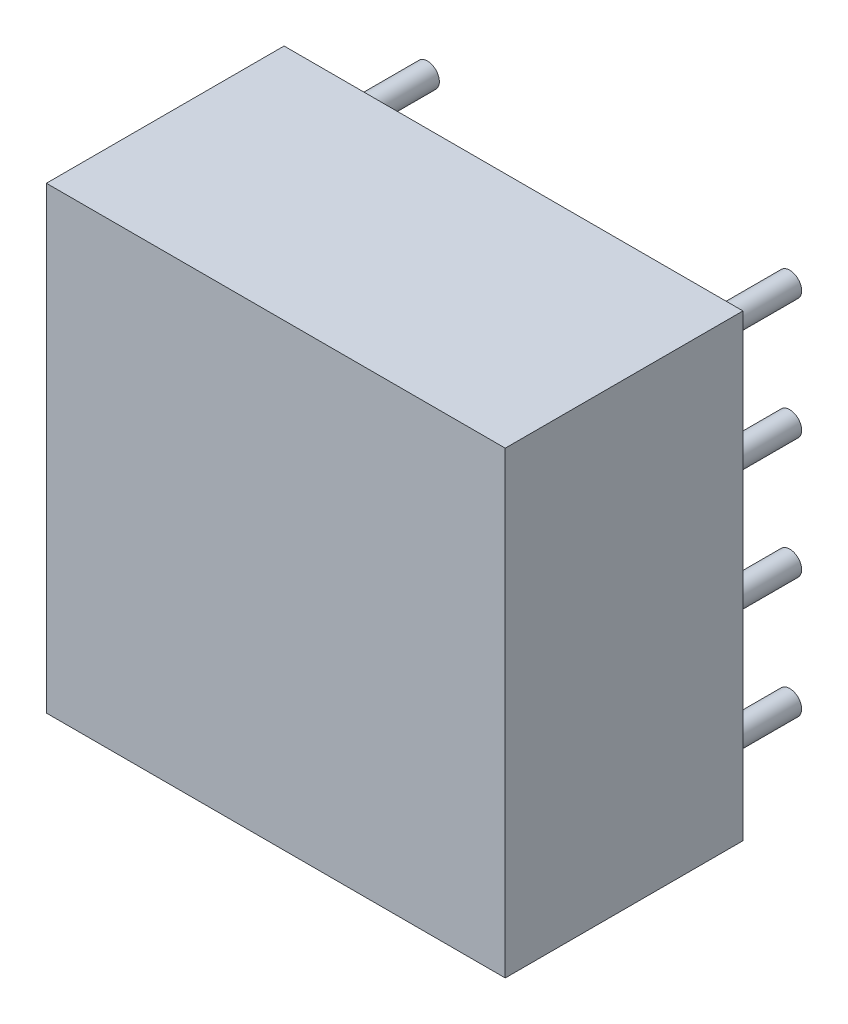
ISO-10303-21;
HEADER;
FILE_DESCRIPTION(('STEP AP214'),'2;1');
FILE_NAME('part.step','',(''),(''),'','','');
FILE_SCHEMA(('AUTOMOTIVE_DESIGN { 1 0 10303 214 1 1 1 1 }'));
ENDSEC;
DATA;
#1=APPLICATION_CONTEXT('core data for automotive mechanical design processes');
#2=APPLICATION_PROTOCOL_DEFINITION('international standard','automotive_design',2000,#1);
#3=PRODUCT_CONTEXT('',#1,'mechanical');
#4=PRODUCT('Part','Part','',(#3));
#5=PRODUCT_RELATED_PRODUCT_CATEGORY('part','',(#4));
#6=PRODUCT_DEFINITION_FORMATION('','',#4);
#7=PRODUCT_DEFINITION_CONTEXT('part definition',#1,'design');
#8=PRODUCT_DEFINITION('design','',#6,#7);
#9=PRODUCT_DEFINITION_SHAPE('','',#8);
#10=(LENGTH_UNIT() NAMED_UNIT(*) SI_UNIT(.MILLI.,.METRE.));
#11=(NAMED_UNIT(*) PLANE_ANGLE_UNIT() SI_UNIT($,.RADIAN.));
#12=(NAMED_UNIT(*) SI_UNIT($,.STERADIAN.) SOLID_ANGLE_UNIT());
#13=UNCERTAINTY_MEASURE_WITH_UNIT(LENGTH_MEASURE(1.E-05),#10,'distance_accuracy_value','');
#14=(GEOMETRIC_REPRESENTATION_CONTEXT(3) GLOBAL_UNCERTAINTY_ASSIGNED_CONTEXT((#13)) GLOBAL_UNIT_ASSIGNED_CONTEXT((#10,
#11,#12)) REPRESENTATION_CONTEXT('',''));
#15=CARTESIAN_POINT('',(0.,0.,0.));
#16=DIRECTION('',(0.,0.,1.));
#17=DIRECTION('',(1.,0.,0.));
#18=AXIS2_PLACEMENT_3D('',#15,#16,#17);
#19=CARTESIAN_POINT('',(7.62,7.62,-2.));
#20=DIRECTION('',(0.,0.,1.));
#21=DIRECTION('',(1.,0.,0.));
#22=AXIS2_PLACEMENT_3D('',#19,#20,#21);
#23=CYLINDRICAL_SURFACE('',#22,0.25);
#24=CARTESIAN_POINT('',(7.62,7.62,-2.));
#25=DIRECTION('',(0.,0.,1.));
#26=DIRECTION('',(1.,0.,0.));
#27=AXIS2_PLACEMENT_3D('',#24,#25,#26);
#28=CIRCLE('',#27,0.25);
#29=CARTESIAN_POINT('',(7.87,7.62,-2.));
#30=VERTEX_POINT('',#29);
#31=EDGE_CURVE('E11',#30,#30,#28,.T.);
#32=ORIENTED_EDGE('',*,*,#31,.T.);
#33=EDGE_LOOP('',(#32));
#34=FACE_BOUND('',#33,.T.);
#35=CARTESIAN_POINT('',(7.62,7.62,0.));
#36=DIRECTION('',(0.,0.,1.));
#37=DIRECTION('',(1.,0.,0.));
#38=AXIS2_PLACEMENT_3D('',#35,#36,#37);
#39=CIRCLE('',#38,0.25);
#40=CARTESIAN_POINT('',(7.87,7.62,0.));
#41=VERTEX_POINT('',#40);
#42=EDGE_CURVE('E43',#41,#41,#39,.T.);
#43=ORIENTED_EDGE('',*,*,#42,.F.);
#44=EDGE_LOOP('',(#43));
#45=FACE_BOUND('',#44,.T.);
#46=ADVANCED_FACE('F40',(#34,#45),#23,.T.);
#47=CARTESIAN_POINT('',(7.62,7.62,-2.));
#48=DIRECTION('',(0.,0.,1.));
#49=DIRECTION('',(1.,0.,0.));
#50=AXIS2_PLACEMENT_3D('',#47,#48,#49);
#51=PLANE('',#50);
#52=ORIENTED_EDGE('',*,*,#31,.F.);
#53=EDGE_LOOP('',(#52));
#54=FACE_BOUND('',#53,.T.);
#55=ADVANCED_FACE('F55',(#54),#51,.F.);
#56=CARTESIAN_POINT('',(7.62,7.62,0.));
#57=DIRECTION('',(0.,0.,1.));
#58=DIRECTION('',(1.,0.,0.));
#59=AXIS2_PLACEMENT_3D('',#56,#57,#58);
#60=PLANE('',#59);
#61=ORIENTED_EDGE('',*,*,#42,.T.);
#62=EDGE_LOOP('',(#61));
#63=FACE_BOUND('',#62,.T.);
#64=ADVANCED_FACE('F52',(#63),#60,.T.);
#65=CLOSED_SHELL('',(#46,#55,#64));
#66=MANIFOLD_SOLID_BREP('B2',#65);
#67=CARTESIAN_POINT('',(7.62,5.08,-2.));
#68=DIRECTION('',(0.,0.,1.));
#69=DIRECTION('',(1.,0.,0.));
#70=AXIS2_PLACEMENT_3D('',#67,#68,#69);
#71=CYLINDRICAL_SURFACE('',#70,0.25);
#72=CARTESIAN_POINT('',(7.62,5.08,-2.));
#73=DIRECTION('',(0.,0.,1.));
#74=DIRECTION('',(1.,0.,0.));
#75=AXIS2_PLACEMENT_3D('',#72,#73,#74);
#76=CIRCLE('',#75,0.25);
#77=CARTESIAN_POINT('',(7.87,5.08,-2.));
#78=VERTEX_POINT('',#77);
#79=EDGE_CURVE('E39',#78,#78,#76,.T.);
#80=ORIENTED_EDGE('',*,*,#79,.T.);
#81=EDGE_LOOP('',(#80));
#82=FACE_BOUND('',#81,.T.);
#83=CARTESIAN_POINT('',(7.62,5.08,0.));
#84=DIRECTION('',(0.,0.,1.));
#85=DIRECTION('',(1.,0.,0.));
#86=AXIS2_PLACEMENT_3D('',#83,#84,#85);
#87=CIRCLE('',#86,0.25);
#88=CARTESIAN_POINT('',(7.87,5.08,0.));
#89=VERTEX_POINT('',#88);
#90=EDGE_CURVE('E92',#89,#89,#87,.T.);
#91=ORIENTED_EDGE('',*,*,#90,.F.);
#92=EDGE_LOOP('',(#91));
#93=FACE_BOUND('',#92,.T.);
#94=ADVANCED_FACE('F89',(#82,#93),#71,.T.);
#95=CARTESIAN_POINT('',(7.62,5.08,-2.));
#96=DIRECTION('',(0.,0.,1.));
#97=DIRECTION('',(1.,0.,0.));
#98=AXIS2_PLACEMENT_3D('',#95,#96,#97);
#99=PLANE('',#98);
#100=ORIENTED_EDGE('',*,*,#79,.F.);
#101=EDGE_LOOP('',(#100));
#102=FACE_BOUND('',#101,.T.);
#103=ADVANCED_FACE('F104',(#102),#99,.F.);
#104=CARTESIAN_POINT('',(7.62,5.08,0.));
#105=DIRECTION('',(0.,0.,1.));
#106=DIRECTION('',(1.,0.,0.));
#107=AXIS2_PLACEMENT_3D('',#104,#105,#106);
#108=PLANE('',#107);
#109=ORIENTED_EDGE('',*,*,#90,.T.);
#110=EDGE_LOOP('',(#109));
#111=FACE_BOUND('',#110,.T.);
#112=ADVANCED_FACE('F101',(#111),#108,.T.);
#113=CLOSED_SHELL('',(#94,#103,#112));
#114=MANIFOLD_SOLID_BREP('B6',#113);
#115=CARTESIAN_POINT('',(7.62,2.54,-2.));
#116=DIRECTION('',(0.,0.,1.));
#117=DIRECTION('',(1.,0.,0.));
#118=AXIS2_PLACEMENT_3D('',#115,#116,#117);
#119=CYLINDRICAL_SURFACE('',#118,0.25);
#120=CARTESIAN_POINT('',(7.62,2.54,-2.));
#121=DIRECTION('',(0.,0.,1.));
#122=DIRECTION('',(1.,0.,0.));
#123=AXIS2_PLACEMENT_3D('',#120,#121,#122);
#124=CIRCLE('',#123,0.25);
#125=CARTESIAN_POINT('',(7.87,2.54,-2.));
#126=VERTEX_POINT('',#125);
#127=EDGE_CURVE('E88',#126,#126,#124,.T.);
#128=ORIENTED_EDGE('',*,*,#127,.T.);
#129=EDGE_LOOP('',(#128));
#130=FACE_BOUND('',#129,.T.);
#131=CARTESIAN_POINT('',(7.62,2.54,0.));
#132=DIRECTION('',(0.,0.,1.));
#133=DIRECTION('',(1.,0.,0.));
#134=AXIS2_PLACEMENT_3D('',#131,#132,#133);
#135=CIRCLE('',#134,0.25);
#136=CARTESIAN_POINT('',(7.87,2.54,0.));
#137=VERTEX_POINT('',#136);
#138=EDGE_CURVE('E141',#137,#137,#135,.T.);
#139=ORIENTED_EDGE('',*,*,#138,.F.);
#140=EDGE_LOOP('',(#139));
#141=FACE_BOUND('',#140,.T.);
#142=ADVANCED_FACE('F138',(#130,#141),#119,.T.);
#143=CARTESIAN_POINT('',(7.62,2.54,-2.));
#144=DIRECTION('',(0.,0.,1.));
#145=DIRECTION('',(1.,0.,0.));
#146=AXIS2_PLACEMENT_3D('',#143,#144,#145);
#147=PLANE('',#146);
#148=ORIENTED_EDGE('',*,*,#127,.F.);
#149=EDGE_LOOP('',(#148));
#150=FACE_BOUND('',#149,.T.);
#151=ADVANCED_FACE('F153',(#150),#147,.F.);
#152=CARTESIAN_POINT('',(7.62,2.54,0.));
#153=DIRECTION('',(0.,0.,1.));
#154=DIRECTION('',(1.,0.,0.));
#155=AXIS2_PLACEMENT_3D('',#152,#153,#154);
#156=PLANE('',#155);
#157=ORIENTED_EDGE('',*,*,#138,.T.);
#158=EDGE_LOOP('',(#157));
#159=FACE_BOUND('',#158,.T.);
#160=ADVANCED_FACE('F150',(#159),#156,.T.);
#161=CLOSED_SHELL('',(#142,#151,#160));
#162=MANIFOLD_SOLID_BREP('B34',#161);
#163=CARTESIAN_POINT('',(7.62,0.,-2.));
#164=DIRECTION('',(0.,0.,1.));
#165=DIRECTION('',(1.,0.,0.));
#166=AXIS2_PLACEMENT_3D('',#163,#164,#165);
#167=CYLINDRICAL_SURFACE('',#166,0.25);
#168=CARTESIAN_POINT('',(7.62,0.,-2.));
#169=DIRECTION('',(0.,0.,1.));
#170=DIRECTION('',(1.,0.,0.));
#171=AXIS2_PLACEMENT_3D('',#168,#169,#170);
#172=CIRCLE('',#171,0.25);
#173=CARTESIAN_POINT('',(7.87,0.,-2.));
#174=VERTEX_POINT('',#173);
#175=EDGE_CURVE('E137',#174,#174,#172,.T.);
#176=ORIENTED_EDGE('',*,*,#175,.T.);
#177=EDGE_LOOP('',(#176));
#178=FACE_BOUND('',#177,.T.);
#179=CARTESIAN_POINT('',(7.62,0.,0.));
#180=DIRECTION('',(0.,0.,1.));
#181=DIRECTION('',(1.,0.,0.));
#182=AXIS2_PLACEMENT_3D('',#179,#180,#181);
#183=CIRCLE('',#182,0.25);
#184=CARTESIAN_POINT('',(7.87,0.,0.));
#185=VERTEX_POINT('',#184);
#186=EDGE_CURVE('E190',#185,#185,#183,.T.);
#187=ORIENTED_EDGE('',*,*,#186,.F.);
#188=EDGE_LOOP('',(#187));
#189=FACE_BOUND('',#188,.T.);
#190=ADVANCED_FACE('F187',(#178,#189),#167,.T.);
#191=CARTESIAN_POINT('',(7.62,0.,-2.));
#192=DIRECTION('',(0.,0.,1.));
#193=DIRECTION('',(1.,0.,0.));
#194=AXIS2_PLACEMENT_3D('',#191,#192,#193);
#195=PLANE('',#194);
#196=ORIENTED_EDGE('',*,*,#175,.F.);
#197=EDGE_LOOP('',(#196));
#198=FACE_BOUND('',#197,.T.);
#199=ADVANCED_FACE('F202',(#198),#195,.F.);
#200=CARTESIAN_POINT('',(7.62,0.,0.));
#201=DIRECTION('',(0.,0.,1.));
#202=DIRECTION('',(1.,0.,0.));
#203=AXIS2_PLACEMENT_3D('',#200,#201,#202);
#204=PLANE('',#203);
#205=ORIENTED_EDGE('',*,*,#186,.T.);
#206=EDGE_LOOP('',(#205));
#207=FACE_BOUND('',#206,.T.);
#208=ADVANCED_FACE('F199',(#207),#204,.T.);
#209=CLOSED_SHELL('',(#190,#199,#208));
#210=MANIFOLD_SOLID_BREP('B83',#209);
#211=CARTESIAN_POINT('',(0.,7.62,-2.));
#212=DIRECTION('',(0.,0.,1.));
#213=DIRECTION('',(1.,0.,0.));
#214=AXIS2_PLACEMENT_3D('',#211,#212,#213);
#215=CYLINDRICAL_SURFACE('',#214,0.25);
#216=CARTESIAN_POINT('',(0.,7.62,-2.));
#217=DIRECTION('',(0.,0.,1.));
#218=DIRECTION('',(1.,0.,0.));
#219=AXIS2_PLACEMENT_3D('',#216,#217,#218);
#220=CIRCLE('',#219,0.25);
#221=CARTESIAN_POINT('',(0.25,7.62,-2.));
#222=VERTEX_POINT('',#221);
#223=EDGE_CURVE('E186',#222,#222,#220,.T.);
#224=ORIENTED_EDGE('',*,*,#223,.T.);
#225=EDGE_LOOP('',(#224));
#226=FACE_BOUND('',#225,.T.);
#227=CARTESIAN_POINT('',(0.,7.62,0.));
#228=DIRECTION('',(0.,0.,1.));
#229=DIRECTION('',(1.,0.,0.));
#230=AXIS2_PLACEMENT_3D('',#227,#228,#229);
#231=CIRCLE('',#230,0.25);
#232=CARTESIAN_POINT('',(0.25,7.62,0.));
#233=VERTEX_POINT('',#232);
#234=EDGE_CURVE('E239',#233,#233,#231,.T.);
#235=ORIENTED_EDGE('',*,*,#234,.F.);
#236=EDGE_LOOP('',(#235));
#237=FACE_BOUND('',#236,.T.);
#238=ADVANCED_FACE('F236',(#226,#237),#215,.T.);
#239=CARTESIAN_POINT('',(0.,7.62,-2.));
#240=DIRECTION('',(0.,0.,1.));
#241=DIRECTION('',(1.,0.,0.));
#242=AXIS2_PLACEMENT_3D('',#239,#240,#241);
#243=PLANE('',#242);
#244=ORIENTED_EDGE('',*,*,#223,.F.);
#245=EDGE_LOOP('',(#244));
#246=FACE_BOUND('',#245,.T.);
#247=ADVANCED_FACE('F251',(#246),#243,.F.);
#248=CARTESIAN_POINT('',(0.,7.62,0.));
#249=DIRECTION('',(0.,0.,1.));
#250=DIRECTION('',(1.,0.,0.));
#251=AXIS2_PLACEMENT_3D('',#248,#249,#250);
#252=PLANE('',#251);
#253=ORIENTED_EDGE('',*,*,#234,.T.);
#254=EDGE_LOOP('',(#253));
#255=FACE_BOUND('',#254,.T.);
#256=ADVANCED_FACE('F248',(#255),#252,.T.);
#257=CLOSED_SHELL('',(#238,#247,#256));
#258=MANIFOLD_SOLID_BREP('B132',#257);
#259=CARTESIAN_POINT('',(0.,5.08,-2.));
#260=DIRECTION('',(0.,0.,1.));
#261=DIRECTION('',(1.,0.,0.));
#262=AXIS2_PLACEMENT_3D('',#259,#260,#261);
#263=CYLINDRICAL_SURFACE('',#262,0.25);
#264=CARTESIAN_POINT('',(0.,5.08,-2.));
#265=DIRECTION('',(0.,0.,1.));
#266=DIRECTION('',(1.,0.,0.));
#267=AXIS2_PLACEMENT_3D('',#264,#265,#266);
#268=CIRCLE('',#267,0.25);
#269=CARTESIAN_POINT('',(0.25,5.08,-2.));
#270=VERTEX_POINT('',#269);
#271=EDGE_CURVE('E235',#270,#270,#268,.T.);
#272=ORIENTED_EDGE('',*,*,#271,.T.);
#273=EDGE_LOOP('',(#272));
#274=FACE_BOUND('',#273,.T.);
#275=CARTESIAN_POINT('',(0.,5.08,0.));
#276=DIRECTION('',(0.,0.,1.));
#277=DIRECTION('',(1.,0.,0.));
#278=AXIS2_PLACEMENT_3D('',#275,#276,#277);
#279=CIRCLE('',#278,0.25);
#280=CARTESIAN_POINT('',(0.25,5.08,0.));
#281=VERTEX_POINT('',#280);
#282=EDGE_CURVE('E288',#281,#281,#279,.T.);
#283=ORIENTED_EDGE('',*,*,#282,.F.);
#284=EDGE_LOOP('',(#283));
#285=FACE_BOUND('',#284,.T.);
#286=ADVANCED_FACE('F285',(#274,#285),#263,.T.);
#287=CARTESIAN_POINT('',(0.,5.08,-2.));
#288=DIRECTION('',(0.,0.,1.));
#289=DIRECTION('',(1.,0.,0.));
#290=AXIS2_PLACEMENT_3D('',#287,#288,#289);
#291=PLANE('',#290);
#292=ORIENTED_EDGE('',*,*,#271,.F.);
#293=EDGE_LOOP('',(#292));
#294=FACE_BOUND('',#293,.T.);
#295=ADVANCED_FACE('F300',(#294),#291,.F.);
#296=CARTESIAN_POINT('',(0.,5.08,0.));
#297=DIRECTION('',(0.,0.,1.));
#298=DIRECTION('',(1.,0.,0.));
#299=AXIS2_PLACEMENT_3D('',#296,#297,#298);
#300=PLANE('',#299);
#301=ORIENTED_EDGE('',*,*,#282,.T.);
#302=EDGE_LOOP('',(#301));
#303=FACE_BOUND('',#302,.T.);
#304=ADVANCED_FACE('F297',(#303),#300,.T.);
#305=CLOSED_SHELL('',(#286,#295,#304));
#306=MANIFOLD_SOLID_BREP('B181',#305);
#307=CARTESIAN_POINT('',(0.,2.54,-2.));
#308=DIRECTION('',(0.,0.,1.));
#309=DIRECTION('',(1.,0.,0.));
#310=AXIS2_PLACEMENT_3D('',#307,#308,#309);
#311=CYLINDRICAL_SURFACE('',#310,0.25);
#312=CARTESIAN_POINT('',(0.,2.54,-2.));
#313=DIRECTION('',(0.,0.,1.));
#314=DIRECTION('',(1.,0.,0.));
#315=AXIS2_PLACEMENT_3D('',#312,#313,#314);
#316=CIRCLE('',#315,0.25);
#317=CARTESIAN_POINT('',(0.25,2.54,-2.));
#318=VERTEX_POINT('',#317);
#319=EDGE_CURVE('E284',#318,#318,#316,.T.);
#320=ORIENTED_EDGE('',*,*,#319,.T.);
#321=EDGE_LOOP('',(#320));
#322=FACE_BOUND('',#321,.T.);
#323=CARTESIAN_POINT('',(0.,2.54,0.));
#324=DIRECTION('',(0.,0.,1.));
#325=DIRECTION('',(1.,0.,0.));
#326=AXIS2_PLACEMENT_3D('',#323,#324,#325);
#327=CIRCLE('',#326,0.25);
#328=CARTESIAN_POINT('',(0.25,2.54,0.));
#329=VERTEX_POINT('',#328);
#330=EDGE_CURVE('E337',#329,#329,#327,.T.);
#331=ORIENTED_EDGE('',*,*,#330,.F.);
#332=EDGE_LOOP('',(#331));
#333=FACE_BOUND('',#332,.T.);
#334=ADVANCED_FACE('F334',(#322,#333),#311,.T.);
#335=CARTESIAN_POINT('',(0.,2.54,-2.));
#336=DIRECTION('',(0.,0.,1.));
#337=DIRECTION('',(1.,0.,0.));
#338=AXIS2_PLACEMENT_3D('',#335,#336,#337);
#339=PLANE('',#338);
#340=ORIENTED_EDGE('',*,*,#319,.F.);
#341=EDGE_LOOP('',(#340));
#342=FACE_BOUND('',#341,.T.);
#343=ADVANCED_FACE('F349',(#342),#339,.F.);
#344=CARTESIAN_POINT('',(0.,2.54,0.));
#345=DIRECTION('',(0.,0.,1.));
#346=DIRECTION('',(1.,0.,0.));
#347=AXIS2_PLACEMENT_3D('',#344,#345,#346);
#348=PLANE('',#347);
#349=ORIENTED_EDGE('',*,*,#330,.T.);
#350=EDGE_LOOP('',(#349));
#351=FACE_BOUND('',#350,.T.);
#352=ADVANCED_FACE('F346',(#351),#348,.T.);
#353=CLOSED_SHELL('',(#334,#343,#352));
#354=MANIFOLD_SOLID_BREP('B230',#353);
#355=CARTESIAN_POINT('',(0.,0.,-2.));
#356=DIRECTION('',(0.,0.,1.));
#357=DIRECTION('',(1.,0.,0.));
#358=AXIS2_PLACEMENT_3D('',#355,#356,#357);
#359=CYLINDRICAL_SURFACE('',#358,0.25);
#360=CARTESIAN_POINT('',(0.,0.,-2.));
#361=DIRECTION('',(0.,0.,1.));
#362=DIRECTION('',(1.,0.,0.));
#363=AXIS2_PLACEMENT_3D('',#360,#361,#362);
#364=CIRCLE('',#363,0.25);
#365=CARTESIAN_POINT('',(0.25,0.,-2.));
#366=VERTEX_POINT('',#365);
#367=EDGE_CURVE('E333',#366,#366,#364,.T.);
#368=ORIENTED_EDGE('',*,*,#367,.T.);
#369=EDGE_LOOP('',(#368));
#370=FACE_BOUND('',#369,.T.);
#371=CARTESIAN_POINT('',(0.,0.,0.));
#372=DIRECTION('',(0.,0.,1.));
#373=DIRECTION('',(1.,0.,0.));
#374=AXIS2_PLACEMENT_3D('',#371,#372,#373);
#375=CIRCLE('',#374,0.25);
#376=CARTESIAN_POINT('',(0.25,0.,0.));
#377=VERTEX_POINT('',#376);
#378=EDGE_CURVE('E387',#377,#377,#375,.T.);
#379=ORIENTED_EDGE('',*,*,#378,.F.);
#380=EDGE_LOOP('',(#379));
#381=FACE_BOUND('',#380,.T.);
#382=ADVANCED_FACE('F384',(#370,#381),#359,.T.);
#383=CARTESIAN_POINT('',(0.,0.,-2.));
#384=DIRECTION('',(0.,0.,1.));
#385=DIRECTION('',(1.,0.,0.));
#386=AXIS2_PLACEMENT_3D('',#383,#384,#385);
#387=PLANE('',#386);
#388=ORIENTED_EDGE('',*,*,#367,.F.);
#389=EDGE_LOOP('',(#388));
#390=FACE_BOUND('',#389,.T.);
#391=ADVANCED_FACE('F399',(#390),#387,.F.);
#392=CARTESIAN_POINT('',(0.,0.,0.));
#393=DIRECTION('',(0.,0.,1.));
#394=DIRECTION('',(1.,0.,0.));
#395=AXIS2_PLACEMENT_3D('',#392,#393,#394);
#396=PLANE('',#395);
#397=ORIENTED_EDGE('',*,*,#378,.T.);
#398=EDGE_LOOP('',(#397));
#399=FACE_BOUND('',#398,.T.);
#400=ADVANCED_FACE('F396',(#399),#396,.T.);
#401=CLOSED_SHELL('',(#382,#391,#400));
#402=MANIFOLD_SOLID_BREP('B279',#401);
#403=CARTESIAN_POINT('',(-1.016,8.636,5.));
#404=DIRECTION('',(1.,0.,0.));
#405=DIRECTION('',(0.,0.,-1.));
#406=AXIS2_PLACEMENT_3D('',#403,#404,#405);
#407=PLANE('',#406);
#408=DIRECTION('',(0.,-1.,0.));
#409=VECTOR('',#408,1.);
#410=CARTESIAN_POINT('',(-1.016,8.636,0.));
#411=LINE('',#410,#409);
#412=CARTESIAN_POINT('',(-1.016,8.636,0.));
#413=VERTEX_POINT('',#412);
#414=CARTESIAN_POINT('',(-1.016,-1.016,0.));
#415=VERTEX_POINT('',#414);
#416=EDGE_CURVE('E488',#413,#415,#411,.T.);
#417=ORIENTED_EDGE('',*,*,#416,.T.);
#418=DIRECTION('',(0.,0.,-1.));
#419=VECTOR('',#418,1.);
#420=CARTESIAN_POINT('',(-1.016,-1.016,5.));
#421=LINE('',#420,#419);
#422=CARTESIAN_POINT('',(-1.016,-1.016,5.));
#423=VERTEX_POINT('',#422);
#424=EDGE_CURVE('E382',#423,#415,#421,.T.);
#425=ORIENTED_EDGE('',*,*,#424,.F.);
#426=DIRECTION('',(0.,-1.,0.));
#427=VECTOR('',#426,1.);
#428=CARTESIAN_POINT('',(-1.016,8.636,5.));
#429=LINE('',#428,#427);
#430=CARTESIAN_POINT('',(-1.016,8.636,5.));
#431=VERTEX_POINT('',#430);
#432=EDGE_CURVE('E476',#431,#423,#429,.T.);
#433=ORIENTED_EDGE('',*,*,#432,.F.);
#434=DIRECTION('',(0.,0.,-1.));
#435=VECTOR('',#434,1.);
#436=CARTESIAN_POINT('',(-1.016,8.636,5.));
#437=LINE('',#436,#435);
#438=EDGE_CURVE('E484',#431,#413,#437,.T.);
#439=ORIENTED_EDGE('',*,*,#438,.T.);
#440=EDGE_LOOP('',(#417,#425,#433,#439));
#441=FACE_BOUND('',#440,.T.);
#442=ADVANCED_FACE('F425',(#441),#407,.F.);
#443=CARTESIAN_POINT('',(-1.016,-1.016,5.));
#444=DIRECTION('',(0.,1.,0.));
#445=DIRECTION('',(0.,0.,1.));
#446=AXIS2_PLACEMENT_3D('',#443,#444,#445);
#447=PLANE('',#446);
#448=DIRECTION('',(1.,0.,0.));
#449=VECTOR('',#448,1.);
#450=CARTESIAN_POINT('',(-1.016,-1.016,0.));
#451=LINE('',#450,#449);
#452=CARTESIAN_POINT('',(8.636,-1.016,0.));
#453=VERTEX_POINT('',#452);
#454=EDGE_CURVE('E480',#415,#453,#451,.T.);
#455=ORIENTED_EDGE('',*,*,#454,.T.);
#456=DIRECTION('',(0.,0.,-1.));
#457=VECTOR('',#456,1.);
#458=CARTESIAN_POINT('',(8.636,-1.016,5.));
#459=LINE('',#458,#457);
#460=CARTESIAN_POINT('',(8.636,-1.016,5.));
#461=VERTEX_POINT('',#460);
#462=EDGE_CURVE('E433',#461,#453,#459,.T.);
#463=ORIENTED_EDGE('',*,*,#462,.F.);
#464=DIRECTION('',(1.,0.,0.));
#465=VECTOR('',#464,1.);
#466=CARTESIAN_POINT('',(-1.016,-1.016,5.));
#467=LINE('',#466,#465);
#468=EDGE_CURVE('E471',#423,#461,#467,.T.);
#469=ORIENTED_EDGE('',*,*,#468,.F.);
#470=ORIENTED_EDGE('',*,*,#424,.T.);
#471=EDGE_LOOP('',(#455,#463,#469,#470));
#472=FACE_BOUND('',#471,.T.);
#473=ADVANCED_FACE('F479',(#472),#447,.F.);
#474=CARTESIAN_POINT('',(8.636,-1.016,5.));
#475=DIRECTION('',(-1.,0.,0.));
#476=DIRECTION('',(0.,0.,1.));
#477=AXIS2_PLACEMENT_3D('',#474,#475,#476);
#478=PLANE('',#477);
#479=DIRECTION('',(0.,1.,0.));
#480=VECTOR('',#479,1.);
#481=CARTESIAN_POINT('',(8.636,-1.016,0.));
#482=LINE('',#481,#480);
#483=CARTESIAN_POINT('',(8.636,8.636,0.));
#484=VERTEX_POINT('',#483);
#485=EDGE_CURVE('E458',#453,#484,#482,.T.);
#486=ORIENTED_EDGE('',*,*,#485,.T.);
#487=DIRECTION('',(0.,0.,-1.));
#488=VECTOR('',#487,1.);
#489=CARTESIAN_POINT('',(8.636,8.636,5.));
#490=LINE('',#489,#488);
#491=CARTESIAN_POINT('',(8.636,8.636,5.));
#492=VERTEX_POINT('',#491);
#493=EDGE_CURVE('E481',#492,#484,#490,.T.);
#494=ORIENTED_EDGE('',*,*,#493,.F.);
#495=DIRECTION('',(0.,1.,0.));
#496=VECTOR('',#495,1.);
#497=CARTESIAN_POINT('',(8.636,-1.016,5.));
#498=LINE('',#497,#496);
#499=EDGE_CURVE('E474',#461,#492,#498,.T.);
#500=ORIENTED_EDGE('',*,*,#499,.F.);
#501=ORIENTED_EDGE('',*,*,#462,.T.);
#502=EDGE_LOOP('',(#486,#494,#500,#501));
#503=FACE_BOUND('',#502,.T.);
#504=ADVANCED_FACE('F482',(#503),#478,.F.);
#505=CARTESIAN_POINT('',(8.636,8.636,5.));
#506=DIRECTION('',(0.,-1.,0.));
#507=DIRECTION('',(0.,0.,-1.));
#508=AXIS2_PLACEMENT_3D('',#505,#506,#507);
#509=PLANE('',#508);
#510=DIRECTION('',(-1.,0.,0.));
#511=VECTOR('',#510,1.);
#512=CARTESIAN_POINT('',(8.636,8.636,0.));
#513=LINE('',#512,#511);
#514=EDGE_CURVE('E464',#484,#413,#513,.T.);
#515=ORIENTED_EDGE('',*,*,#514,.T.);
#516=ORIENTED_EDGE('',*,*,#438,.F.);
#517=DIRECTION('',(-1.,0.,0.));
#518=VECTOR('',#517,1.);
#519=CARTESIAN_POINT('',(8.636,8.636,5.));
#520=LINE('',#519,#518);
#521=EDGE_CURVE('E441',#492,#431,#520,.T.);
#522=ORIENTED_EDGE('',*,*,#521,.F.);
#523=ORIENTED_EDGE('',*,*,#493,.T.);
#524=EDGE_LOOP('',(#515,#516,#522,#523));
#525=FACE_BOUND('',#524,.T.);
#526=ADVANCED_FACE('F495',(#525),#509,.F.);
#527=CARTESIAN_POINT('',(0.,0.,5.));
#528=DIRECTION('',(0.,0.,1.));
#529=DIRECTION('',(1.,0.,0.));
#530=AXIS2_PLACEMENT_3D('',#527,#528,#529);
#531=PLANE('',#530);
#532=ORIENTED_EDGE('',*,*,#432,.T.);
#533=ORIENTED_EDGE('',*,*,#468,.T.);
#534=ORIENTED_EDGE('',*,*,#499,.T.);
#535=ORIENTED_EDGE('',*,*,#521,.T.);
#536=EDGE_LOOP('',(#532,#533,#534,#535));
#537=FACE_BOUND('',#536,.T.);
#538=ADVANCED_FACE('F472',(#537),#531,.T.);
#539=CARTESIAN_POINT('',(0.,0.,0.));
#540=DIRECTION('',(0.,0.,1.));
#541=DIRECTION('',(1.,0.,0.));
#542=AXIS2_PLACEMENT_3D('',#539,#540,#541);
#543=PLANE('',#542);
#544=ORIENTED_EDGE('',*,*,#416,.F.);
#545=ORIENTED_EDGE('',*,*,#514,.F.);
#546=ORIENTED_EDGE('',*,*,#485,.F.);
#547=ORIENTED_EDGE('',*,*,#454,.F.);
#548=EDGE_LOOP('',(#544,#545,#546,#547));
#549=FACE_BOUND('',#548,.T.);
#550=ADVANCED_FACE('F498',(#549),#543,.F.);
#551=CLOSED_SHELL('',(#442,#473,#504,#526,#538,#550));
#552=MANIFOLD_SOLID_BREP('B328',#551);
#553=ADVANCED_BREP_SHAPE_REPRESENTATION('',(#18,#66,#114,#162,#210,#258,#306,#354,#402,#552),#14);
#554=SHAPE_DEFINITION_REPRESENTATION(#9,#553);
ENDSEC;
END-ISO-10303-21;
